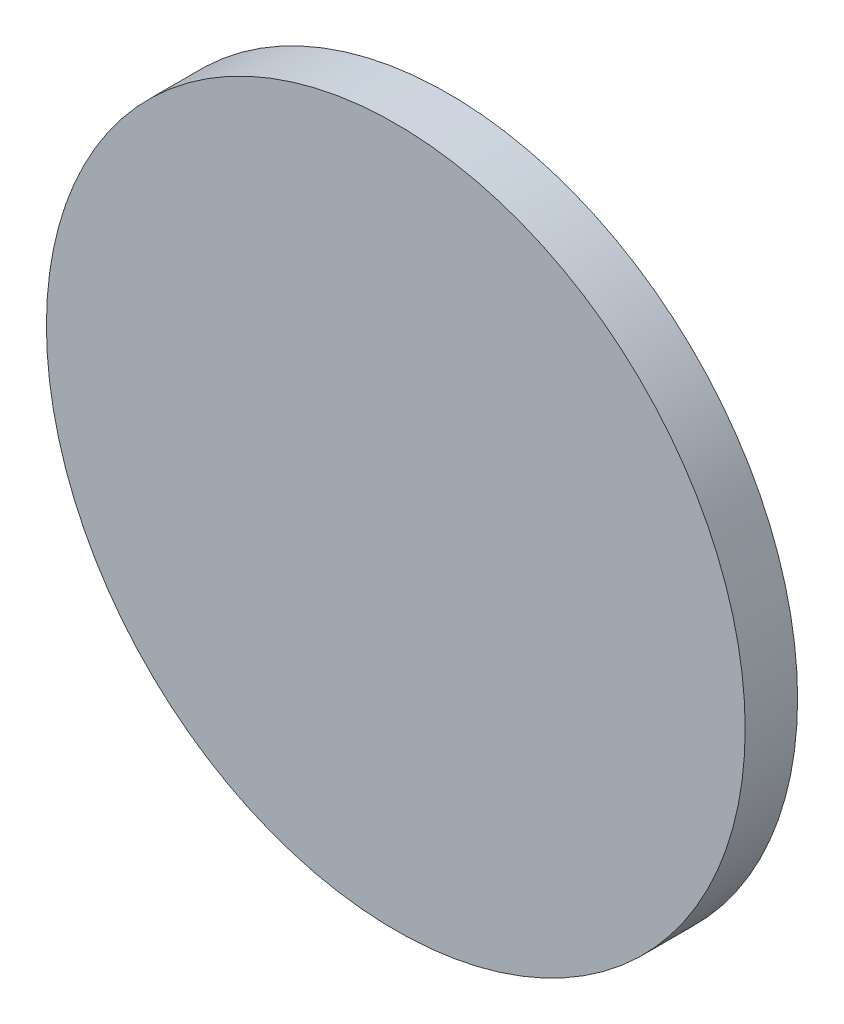
ISO-10303-21;
HEADER;
FILE_DESCRIPTION(('STEP AP214'),'2;1');
FILE_NAME('part.step','',(''),(''),'','','');
FILE_SCHEMA(('AUTOMOTIVE_DESIGN { 1 0 10303 214 1 1 1 1 }'));
ENDSEC;
DATA;
#1=APPLICATION_CONTEXT('core data for automotive mechanical design processes');
#2=APPLICATION_PROTOCOL_DEFINITION('international standard','automotive_design',2000,#1);
#3=PRODUCT_CONTEXT('',#1,'mechanical');
#4=PRODUCT('Part','Part','',(#3));
#5=PRODUCT_RELATED_PRODUCT_CATEGORY('part','',(#4));
#6=PRODUCT_DEFINITION_FORMATION('','',#4);
#7=PRODUCT_DEFINITION_CONTEXT('part definition',#1,'design');
#8=PRODUCT_DEFINITION('design','',#6,#7);
#9=PRODUCT_DEFINITION_SHAPE('','',#8);
#10=(LENGTH_UNIT() NAMED_UNIT(*) SI_UNIT(.MILLI.,.METRE.));
#11=(NAMED_UNIT(*) PLANE_ANGLE_UNIT() SI_UNIT($,.RADIAN.));
#12=(NAMED_UNIT(*) SI_UNIT($,.STERADIAN.) SOLID_ANGLE_UNIT());
#13=UNCERTAINTY_MEASURE_WITH_UNIT(LENGTH_MEASURE(1.E-05),#10,'distance_accuracy_value','');
#14=(GEOMETRIC_REPRESENTATION_CONTEXT(3) GLOBAL_UNCERTAINTY_ASSIGNED_CONTEXT((#13)) GLOBAL_UNIT_ASSIGNED_CONTEXT((#10,
#11,#12)) REPRESENTATION_CONTEXT('',''));
#15=CARTESIAN_POINT('',(0.,0.,0.));
#16=DIRECTION('',(0.,0.,1.));
#17=DIRECTION('',(1.,0.,0.));
#18=AXIS2_PLACEMENT_3D('',#15,#16,#17);
#19=CARTESIAN_POINT('',(8.34916,16.03491,0.03429));
#20=DIRECTION('',(0.,0.,1.));
#21=DIRECTION('',(1.,0.,0.));
#22=AXIS2_PLACEMENT_3D('',#19,#20,#21);
#23=PLANE('',#22);
#24=CARTESIAN_POINT('',(8.34916,16.03491,0.03429));
#25=DIRECTION('',(0.,0.,1.));
#26=DIRECTION('',(1.,0.,0.));
#27=AXIS2_PLACEMENT_3D('',#24,#25,#26);
#28=CIRCLE('',#27,0.2286);
#29=CARTESIAN_POINT('',(8.57776,16.03491,0.03429));
#30=VERTEX_POINT('',#29);
#31=EDGE_CURVE('E18',#30,#30,#28,.F.);
#32=ORIENTED_EDGE('',*,*,#31,.F.);
#33=EDGE_LOOP('',(#32));
#34=FACE_BOUND('',#33,.T.);
#35=ADVANCED_FACE('F15',(#34),#23,.T.);
#36=CARTESIAN_POINT('',(8.34916,16.03491,0.));
#37=DIRECTION('',(0.,0.,1.));
#38=DIRECTION('',(1.,0.,0.));
#39=AXIS2_PLACEMENT_3D('',#36,#37,#38);
#40=CYLINDRICAL_SURFACE('',#39,0.2286);
#41=ORIENTED_EDGE('',*,*,#31,.T.);
#42=EDGE_LOOP('',(#41));
#43=FACE_BOUND('',#42,.T.);
#44=CARTESIAN_POINT('',(8.34916,16.03491,0.));
#45=DIRECTION('',(0.,0.,1.));
#46=DIRECTION('',(1.,0.,0.));
#47=AXIS2_PLACEMENT_3D('',#44,#45,#46);
#48=CIRCLE('',#47,0.2286);
#49=CARTESIAN_POINT('',(8.57776,16.03491,0.));
#50=VERTEX_POINT('',#49);
#51=EDGE_CURVE('E10',#50,#50,#48,.F.);
#52=ORIENTED_EDGE('',*,*,#51,.F.);
#53=EDGE_LOOP('',(#52));
#54=FACE_BOUND('',#53,.T.);
#55=ADVANCED_FACE('F27',(#43,#54),#40,.T.);
#56=CARTESIAN_POINT('',(8.34916,16.03491,0.));
#57=DIRECTION('',(0.,0.,-1.));
#58=DIRECTION('',(-1.,0.,0.));
#59=AXIS2_PLACEMENT_3D('',#56,#57,#58);
#60=PLANE('',#59);
#61=ORIENTED_EDGE('',*,*,#51,.T.);
#62=EDGE_LOOP('',(#61));
#63=FACE_BOUND('',#62,.T.);
#64=ADVANCED_FACE('F35',(#63),#60,.T.);
#65=CLOSED_SHELL('',(#35,#55,#64));
#66=MANIFOLD_SOLID_BREP('B1',#65);
#67=ADVANCED_BREP_SHAPE_REPRESENTATION('',(#18,#66),#14);
#68=SHAPE_DEFINITION_REPRESENTATION(#9,#67);
ENDSEC;
END-ISO-10303-21;
